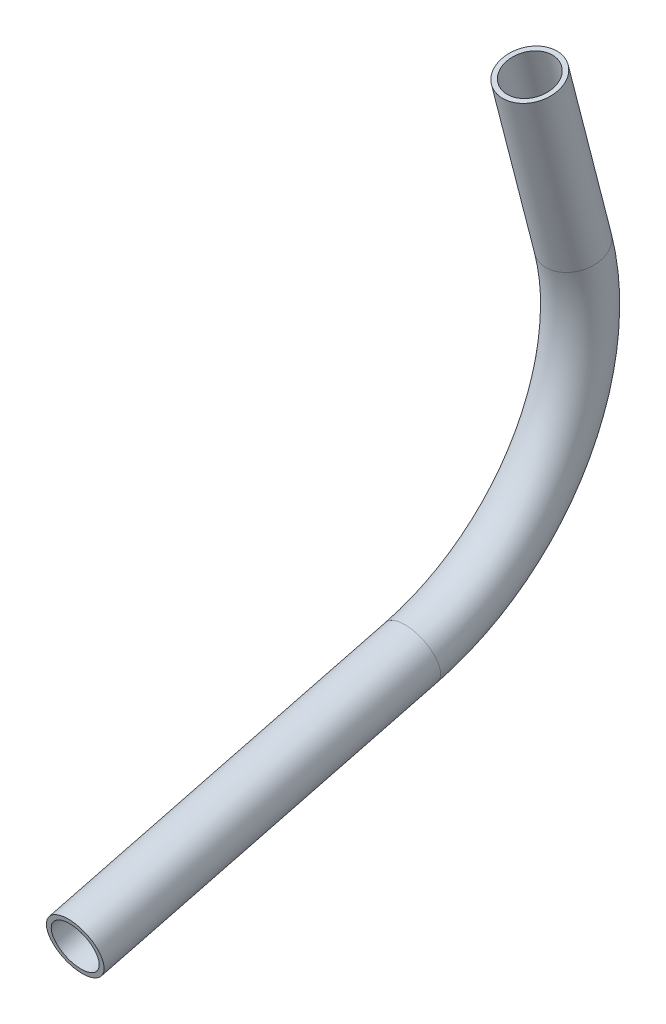
ISO-10303-21;
HEADER;
FILE_DESCRIPTION(('STEP AP214'),'2;1');
FILE_NAME('part.step','',(''),(''),'','','');
FILE_SCHEMA(('AUTOMOTIVE_DESIGN { 1 0 10303 214 1 1 1 1 }'));
ENDSEC;
DATA;
#1=APPLICATION_CONTEXT('core data for automotive mechanical design processes');
#2=APPLICATION_PROTOCOL_DEFINITION('international standard','automotive_design',2000,#1);
#3=PRODUCT_CONTEXT('',#1,'mechanical');
#4=PRODUCT('Part','Part','',(#3));
#5=PRODUCT_RELATED_PRODUCT_CATEGORY('part','',(#4));
#6=PRODUCT_DEFINITION_FORMATION('','',#4);
#7=PRODUCT_DEFINITION_CONTEXT('part definition',#1,'design');
#8=PRODUCT_DEFINITION('design','',#6,#7);
#9=PRODUCT_DEFINITION_SHAPE('','',#8);
#10=(LENGTH_UNIT() NAMED_UNIT(*) SI_UNIT(.MILLI.,.METRE.));
#11=(NAMED_UNIT(*) PLANE_ANGLE_UNIT() SI_UNIT($,.RADIAN.));
#12=(NAMED_UNIT(*) SI_UNIT($,.STERADIAN.) SOLID_ANGLE_UNIT());
#13=UNCERTAINTY_MEASURE_WITH_UNIT(LENGTH_MEASURE(1.E-05),#10,'distance_accuracy_value','');
#14=(GEOMETRIC_REPRESENTATION_CONTEXT(3) GLOBAL_UNCERTAINTY_ASSIGNED_CONTEXT((#13)) GLOBAL_UNIT_ASSIGNED_CONTEXT((#10,
#11,#12)) REPRESENTATION_CONTEXT('',''));
#15=CARTESIAN_POINT('',(0.,0.,0.));
#16=DIRECTION('',(0.,0.,1.));
#17=DIRECTION('',(1.,0.,0.));
#18=AXIS2_PLACEMENT_3D('',#15,#16,#17);
#19=CARTESIAN_POINT('',(0.,653.098730334499,114.614273635844));
#20=DIRECTION('',(0.,-0.249132954877775,0.968469292643741));
#21=DIRECTION('',(0.,-0.968469292643741,-0.249132954877775));
#22=AXIS2_PLACEMENT_3D('',#19,#20,#21);
#23=CYLINDRICAL_SURFACE('',#22,5.28319999999996);
#24=CARTESIAN_POINT('',(0.,633.468785437189,190.922921195777));
#25=DIRECTION('',(0.,0.249132954877775,-0.968469292643741));
#26=DIRECTION('',(0.,0.968469292643741,0.249132954877775));
#27=AXIS2_PLACEMENT_3D('',#24,#25,#26);
#28=CIRCLE('',#27,5.28319999999996);
#29=CARTESIAN_POINT('',(0.,638.585402404085,192.239140422987));
#30=VERTEX_POINT('',#29);
#31=EDGE_CURVE('E55',#30,#30,#28,.T.);
#32=ORIENTED_EDGE('',*,*,#31,.F.);
#33=EDGE_LOOP('',(#32));
#34=FACE_BOUND('',#33,.T.);
#35=CARTESIAN_POINT('',(0.,653.098730334499,114.614273635844));
#36=DIRECTION('',(0.,0.249132954877775,-0.968469292643741));
#37=DIRECTION('',(0.,0.968469292643741,0.249132954877775));
#38=AXIS2_PLACEMENT_3D('',#35,#36,#37);
#39=CIRCLE('',#38,5.28319999999996);
#40=CARTESIAN_POINT('',(0.,658.215347301394,115.930492863055));
#41=VERTEX_POINT('',#40);
#42=EDGE_CURVE('E51',#41,#41,#39,.T.);
#43=ORIENTED_EDGE('',*,*,#42,.T.);
#44=EDGE_LOOP('',(#43));
#45=FACE_BOUND('',#44,.T.);
#46=ADVANCED_FACE('F47',(#34,#45),#23,.F.);
#47=CARTESIAN_POINT('',(0.,653.098730334499,114.614273635844));
#48=DIRECTION('',(0.,-0.249132954877775,0.968469292643741));
#49=DIRECTION('',(0.,-0.968469292643741,-0.249132954877775));
#50=AXIS2_PLACEMENT_3D('',#47,#48,#49);
#51=CYLINDRICAL_SURFACE('',#50,6.34999999999996);
#52=CARTESIAN_POINT('',(0.,633.468785437189,190.922921195777));
#53=DIRECTION('',(0.,0.249132954877775,-0.968469292643741));
#54=DIRECTION('',(0.,0.968469292643741,0.249132954877775));
#55=AXIS2_PLACEMENT_3D('',#52,#53,#54);
#56=CIRCLE('',#55,6.34999999999996);
#57=CARTESIAN_POINT('',(0.,639.618565445477,192.504915459251));
#58=VERTEX_POINT('',#57);
#59=EDGE_CURVE('E59',#58,#58,#56,.T.);
#60=ORIENTED_EDGE('',*,*,#59,.T.);
#61=EDGE_LOOP('',(#60));
#62=FACE_BOUND('',#61,.T.);
#63=CARTESIAN_POINT('',(0.,653.098730334499,114.614273635844));
#64=DIRECTION('',(0.,0.249132954877775,-0.968469292643741));
#65=DIRECTION('',(0.,0.968469292643741,0.249132954877775));
#66=AXIS2_PLACEMENT_3D('',#63,#64,#65);
#67=CIRCLE('',#66,6.34999999999996);
#68=CARTESIAN_POINT('',(0.,659.248510342786,116.196267899318));
#69=VERTEX_POINT('',#68);
#70=EDGE_CURVE('E12',#69,#69,#67,.T.);
#71=ORIENTED_EDGE('',*,*,#70,.F.);
#72=EDGE_LOOP('',(#71));
#73=FACE_BOUND('',#72,.T.);
#74=ADVANCED_FACE('F74',(#62,#73),#51,.T.);
#75=CARTESIAN_POINT('',(0.,633.468785437189,190.922921195777));
#76=DIRECTION('',(0.,0.249132954877775,-0.968469292643741));
#77=DIRECTION('',(0.,0.968469292643741,0.249132954877775));
#78=AXIS2_PLACEMENT_3D('',#75,#76,#77);
#79=PLANE('',#78);
#80=ORIENTED_EDGE('',*,*,#31,.T.);
#81=EDGE_LOOP('',(#80));
#82=FACE_BOUND('',#81,.T.);
#83=ORIENTED_EDGE('',*,*,#59,.F.);
#84=EDGE_LOOP('',(#83));
#85=FACE_BOUND('',#84,.T.);
#86=ADVANCED_FACE('F70',(#82,#85),#79,.F.);
#87=CARTESIAN_POINT('',(0.,653.098730334499,114.614273635844));
#88=DIRECTION('',(0.,0.249132954877775,-0.968469292643741));
#89=DIRECTION('',(0.,0.968469292643741,0.249132954877775));
#90=AXIS2_PLACEMENT_3D('',#87,#88,#89);
#91=PLANE('',#90);
#92=ORIENTED_EDGE('',*,*,#42,.F.);
#93=EDGE_LOOP('',(#92));
#94=FACE_BOUND('',#93,.T.);
#95=ORIENTED_EDGE('',*,*,#70,.T.);
#96=EDGE_LOOP('',(#95));
#97=FACE_BOUND('',#96,.T.);
#98=ADVANCED_FACE('F49',(#94,#97),#91,.T.);
#99=CLOSED_SHELL('',(#46,#74,#86,#98));
#100=MANIFOLD_SOLID_BREP('B2',#99);
#101=CARTESIAN_POINT('',(0.,702.296970400801,127.270227743635));
#102=DIRECTION('',(-1.,0.,0.));
#103=DIRECTION('',(0.,0.,1.));
#104=AXIS2_PLACEMENT_3D('',#101,#102,#103);
#105=TOROIDAL_SURFACE('',#104,50.8000000000002,5.28319999999996);
#106=CARTESIAN_POINT('',(0.,714.952924508592,78.0719876773331));
#107=DIRECTION('',(0.,0.968469292643741,0.249132954877776));
#108=DIRECTION('',(0.,-0.249132954877776,0.968469292643741));
#109=AXIS2_PLACEMENT_3D('',#106,#107,#108);
#110=CIRCLE('',#109,5.28319999999996);
#111=CARTESIAN_POINT('',(0.,716.269143735802,72.9553707104377));
#112=VERTEX_POINT('',#111);
#113=EDGE_CURVE('E150',#112,#112,#110,.T.);
#114=CARTESIAN_POINT('',(0.,653.098730334499,114.614273635844));
#115=DIRECTION('',(0.,-0.249132954877775,0.968469292643741));
#116=DIRECTION('',(0.,-0.968469292643741,-0.249132954877775));
#117=AXIS2_PLACEMENT_3D('',#114,#115,#116);
#118=CIRCLE('',#117,5.28319999999996);
#119=CARTESIAN_POINT('',(0.,647.982113367603,113.298054408634));
#120=VERTEX_POINT('',#119);
#121=EDGE_CURVE('E140',#120,#120,#118,.T.);
#122=CARTESIAN_POINT('',(0.,702.296970400801,127.270227743635));
#123=DIRECTION('',(-1.,0.,0.));
#124=DIRECTION('',(0.,0.,1.));
#125=AXIS2_PLACEMENT_3D('',#122,#123,#124);
#126=CIRCLE('',#125,56.0832000000001);
#127=EDGE_CURVE('',#112,#120,#126,.T.);
#128=ORIENTED_EDGE('',*,*,#113,.T.);
#129=ORIENTED_EDGE('',*,*,#121,.T.);
#130=ORIENTED_EDGE('',*,*,#127,.T.);
#131=ORIENTED_EDGE('',*,*,#127,.F.);
#132=EDGE_LOOP('',(#128,#130,#129,#131));
#133=FACE_BOUND('',#132,.T.);
#134=ADVANCED_FACE('F136',(#133),#105,.F.);
#135=CARTESIAN_POINT('',(0.,702.296970400801,127.270227743635));
#136=DIRECTION('',(-1.,0.,0.));
#137=DIRECTION('',(0.,0.,1.));
#138=AXIS2_PLACEMENT_3D('',#135,#136,#137);
#139=TOROIDAL_SURFACE('',#138,50.8000000000002,6.34999999999996);
#140=CARTESIAN_POINT('',(0.,714.952924508592,78.0719876773331));
#141=DIRECTION('',(0.,0.968469292643741,0.249132954877776));
#142=DIRECTION('',(0.,-0.249132954877776,0.968469292643741));
#143=AXIS2_PLACEMENT_3D('',#140,#141,#142);
#144=CIRCLE('',#143,6.34999999999996);
#145=CARTESIAN_POINT('',(0.,716.534918772066,71.9222076690454));
#146=VERTEX_POINT('',#145);
#147=EDGE_CURVE('E144',#146,#146,#144,.T.);
#148=CARTESIAN_POINT('',(0.,653.098730334499,114.614273635844));
#149=DIRECTION('',(0.,-0.249132954877775,0.968469292643741));
#150=DIRECTION('',(0.,-0.968469292643741,-0.249132954877775));
#151=AXIS2_PLACEMENT_3D('',#148,#149,#150);
#152=CIRCLE('',#151,6.34999999999996);
#153=CARTESIAN_POINT('',(0.,646.948950326211,113.03227937237));
#154=VERTEX_POINT('',#153);
#155=EDGE_CURVE('E46',#154,#154,#152,.T.);
#156=CARTESIAN_POINT('',(0.,702.296970400801,127.270227743635));
#157=DIRECTION('',(-1.,0.,0.));
#158=DIRECTION('',(0.,0.,1.));
#159=AXIS2_PLACEMENT_3D('',#156,#157,#158);
#160=CIRCLE('',#159,57.1500000000001);
#161=EDGE_CURVE('',#146,#154,#160,.T.);
#162=ORIENTED_EDGE('',*,*,#147,.F.);
#163=ORIENTED_EDGE('',*,*,#155,.F.);
#164=ORIENTED_EDGE('',*,*,#161,.T.);
#165=ORIENTED_EDGE('',*,*,#161,.F.);
#166=EDGE_LOOP('',(#162,#164,#163,#165));
#167=FACE_BOUND('',#166,.T.);
#168=ADVANCED_FACE('F163',(#167),#139,.T.);
#169=CARTESIAN_POINT('',(0.,714.952924508592,78.0719876773332));
#170=DIRECTION('',(0.,0.968469292643741,0.249132954877776));
#171=DIRECTION('',(0.,-0.249132954877776,0.968469292643741));
#172=AXIS2_PLACEMENT_3D('',#169,#170,#171);
#173=PLANE('',#172);
#174=ORIENTED_EDGE('',*,*,#113,.F.);
#175=EDGE_LOOP('',(#174));
#176=FACE_BOUND('',#175,.T.);
#177=ORIENTED_EDGE('',*,*,#147,.T.);
#178=EDGE_LOOP('',(#177));
#179=FACE_BOUND('',#178,.T.);
#180=ADVANCED_FACE('F159',(#176,#179),#173,.T.);
#181=CARTESIAN_POINT('',(0.,653.098730334499,114.614273635844));
#182=DIRECTION('',(0.,-0.249132954877775,0.968469292643741));
#183=DIRECTION('',(0.,-0.968469292643741,-0.249132954877775));
#184=AXIS2_PLACEMENT_3D('',#181,#182,#183);
#185=PLANE('',#184);
#186=ORIENTED_EDGE('',*,*,#121,.F.);
#187=EDGE_LOOP('',(#186));
#188=FACE_BOUND('',#187,.T.);
#189=ORIENTED_EDGE('',*,*,#155,.T.);
#190=EDGE_LOOP('',(#189));
#191=FACE_BOUND('',#190,.T.);
#192=ADVANCED_FACE('F138',(#188,#191),#185,.T.);
#193=CLOSED_SHELL('',(#134,#168,#180,#192));
#194=MANIFOLD_SOLID_BREP('B7',#193);
#195=CARTESIAN_POINT('',(0.,753.052924508592,87.8729856572816));
#196=DIRECTION('',(0.,-0.968469292643741,-0.249132954877776));
#197=DIRECTION('',(0.,0.249132954877776,-0.968469292643741));
#198=AXIS2_PLACEMENT_3D('',#195,#196,#197);
#199=CYLINDRICAL_SURFACE('',#198,5.28319999999996);
#200=CARTESIAN_POINT('',(0.,753.052924508592,87.8729856572816));
#201=DIRECTION('',(0.,0.968469292643741,0.249132954877776));
#202=DIRECTION('',(0.,-0.249132954877776,0.968469292643741));
#203=AXIS2_PLACEMENT_3D('',#200,#201,#202);
#204=CIRCLE('',#203,5.28319999999996);
#205=CARTESIAN_POINT('',(0.,751.736705281382,92.9896026241769));
#206=VERTEX_POINT('',#205);
#207=EDGE_CURVE('E234',#206,#206,#204,.T.);
#208=ORIENTED_EDGE('',*,*,#207,.T.);
#209=EDGE_LOOP('',(#208));
#210=FACE_BOUND('',#209,.T.);
#211=CARTESIAN_POINT('',(0.,714.952924508592,78.0719876773333));
#212=DIRECTION('',(0.,-0.968469292643741,-0.249132954877776));
#213=DIRECTION('',(0.,0.249132954877776,-0.968469292643741));
#214=AXIS2_PLACEMENT_3D('',#211,#212,#213);
#215=CIRCLE('',#214,5.28319999999996);
#216=CARTESIAN_POINT('',(0.,716.269143735802,72.9553707104379));
#217=VERTEX_POINT('',#216);
#218=EDGE_CURVE('E224',#217,#217,#215,.T.);
#219=ORIENTED_EDGE('',*,*,#218,.T.);
#220=EDGE_LOOP('',(#219));
#221=FACE_BOUND('',#220,.T.);
#222=ADVANCED_FACE('F220',(#210,#221),#199,.F.);
#223=CARTESIAN_POINT('',(0.,753.052924508592,87.8729856572816));
#224=DIRECTION('',(0.,-0.968469292643741,-0.249132954877776));
#225=DIRECTION('',(0.,0.249132954877776,-0.968469292643741));
#226=AXIS2_PLACEMENT_3D('',#223,#224,#225);
#227=CYLINDRICAL_SURFACE('',#226,6.34999999999996);
#228=CARTESIAN_POINT('',(0.,753.052924508592,87.8729856572816));
#229=DIRECTION('',(0.,0.968469292643741,0.249132954877776));
#230=DIRECTION('',(0.,-0.249132954877776,0.968469292643741));
#231=AXIS2_PLACEMENT_3D('',#228,#229,#230);
#232=CIRCLE('',#231,6.34999999999996);
#233=CARTESIAN_POINT('',(0.,751.470930245118,94.0227656655693));
#234=VERTEX_POINT('',#233);
#235=EDGE_CURVE('E228',#234,#234,#232,.T.);
#236=ORIENTED_EDGE('',*,*,#235,.F.);
#237=EDGE_LOOP('',(#236));
#238=FACE_BOUND('',#237,.T.);
#239=CARTESIAN_POINT('',(0.,714.952924508592,78.0719876773333));
#240=DIRECTION('',(0.,-0.968469292643741,-0.249132954877776));
#241=DIRECTION('',(0.,0.249132954877776,-0.968469292643741));
#242=AXIS2_PLACEMENT_3D('',#239,#240,#241);
#243=CIRCLE('',#242,6.34999999999996);
#244=CARTESIAN_POINT('',(0.,716.534918772066,71.9222076690455));
#245=VERTEX_POINT('',#244);
#246=EDGE_CURVE('E135',#245,#245,#243,.T.);
#247=ORIENTED_EDGE('',*,*,#246,.F.);
#248=EDGE_LOOP('',(#247));
#249=FACE_BOUND('',#248,.T.);
#250=ADVANCED_FACE('F247',(#238,#249),#227,.T.);
#251=CARTESIAN_POINT('',(0.,753.052924508592,87.8729856572816));
#252=DIRECTION('',(0.,0.968469292643741,0.249132954877776));
#253=DIRECTION('',(0.,-0.249132954877776,0.968469292643741));
#254=AXIS2_PLACEMENT_3D('',#251,#252,#253);
#255=PLANE('',#254);
#256=ORIENTED_EDGE('',*,*,#207,.F.);
#257=EDGE_LOOP('',(#256));
#258=FACE_BOUND('',#257,.T.);
#259=ORIENTED_EDGE('',*,*,#235,.T.);
#260=EDGE_LOOP('',(#259));
#261=FACE_BOUND('',#260,.T.);
#262=ADVANCED_FACE('F243',(#258,#261),#255,.T.);
#263=CARTESIAN_POINT('',(0.,714.952924508592,78.0719876773332));
#264=DIRECTION('',(0.,-0.968469292643741,-0.249132954877776));
#265=DIRECTION('',(0.,0.249132954877776,-0.968469292643741));
#266=AXIS2_PLACEMENT_3D('',#263,#264,#265);
#267=PLANE('',#266);
#268=ORIENTED_EDGE('',*,*,#218,.F.);
#269=EDGE_LOOP('',(#268));
#270=FACE_BOUND('',#269,.T.);
#271=ORIENTED_EDGE('',*,*,#246,.T.);
#272=EDGE_LOOP('',(#271));
#273=FACE_BOUND('',#272,.T.);
#274=ADVANCED_FACE('F222',(#270,#273),#267,.T.);
#275=CLOSED_SHELL('',(#222,#250,#262,#274));
#276=MANIFOLD_SOLID_BREP('B41',#275);
#277=ADVANCED_BREP_SHAPE_REPRESENTATION('',(#18,#100,#194,#276),#14);
#278=SHAPE_DEFINITION_REPRESENTATION(#9,#277);
ENDSEC;
END-ISO-10303-21;
